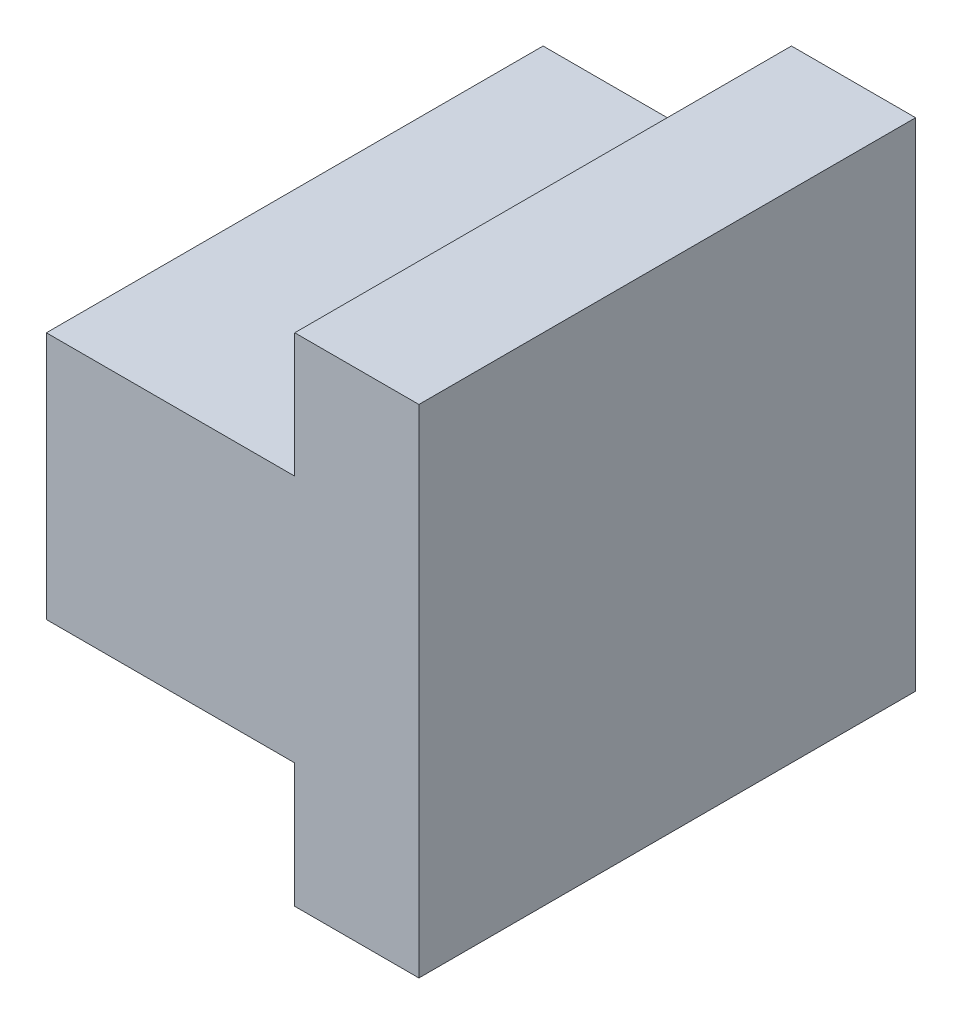
ISO-10303-21;
HEADER;
FILE_DESCRIPTION(('STEP AP214'),'2;1');
FILE_NAME('part.step','',(''),(''),'','','');
FILE_SCHEMA(('AUTOMOTIVE_DESIGN { 1 0 10303 214 1 1 1 1 }'));
ENDSEC;
DATA;
#1=APPLICATION_CONTEXT('core data for automotive mechanical design processes');
#2=APPLICATION_PROTOCOL_DEFINITION('international standard','automotive_design',2000,#1);
#3=PRODUCT_CONTEXT('',#1,'mechanical');
#4=PRODUCT('Part','Part','',(#3));
#5=PRODUCT_RELATED_PRODUCT_CATEGORY('part','',(#4));
#6=PRODUCT_DEFINITION_FORMATION('','',#4);
#7=PRODUCT_DEFINITION_CONTEXT('part definition',#1,'design');
#8=PRODUCT_DEFINITION('design','',#6,#7);
#9=PRODUCT_DEFINITION_SHAPE('','',#8);
#10=(LENGTH_UNIT() NAMED_UNIT(*) SI_UNIT(.MILLI.,.METRE.));
#11=(NAMED_UNIT(*) PLANE_ANGLE_UNIT() SI_UNIT($,.RADIAN.));
#12=(NAMED_UNIT(*) SI_UNIT($,.STERADIAN.) SOLID_ANGLE_UNIT());
#13=UNCERTAINTY_MEASURE_WITH_UNIT(LENGTH_MEASURE(1.E-05),#10,'distance_accuracy_value','');
#14=(GEOMETRIC_REPRESENTATION_CONTEXT(3) GLOBAL_UNCERTAINTY_ASSIGNED_CONTEXT((#13)) GLOBAL_UNIT_ASSIGNED_CONTEXT((#10,
#11,#12)) REPRESENTATION_CONTEXT('',''));
#15=CARTESIAN_POINT('',(0.,0.,0.));
#16=DIRECTION('',(0.,0.,1.));
#17=DIRECTION('',(1.,0.,0.));
#18=AXIS2_PLACEMENT_3D('',#15,#16,#17);
#19=CARTESIAN_POINT('',(1.,0.,4.));
#20=DIRECTION('',(0.,1.,0.));
#21=DIRECTION('',(-1.,0.,0.));
#22=AXIS2_PLACEMENT_3D('',#19,#20,#21);
#23=PLANE('',#22);
#24=DIRECTION('',(0.,0.,-1.));
#25=VECTOR('',#24,1.);
#26=CARTESIAN_POINT('',(1.,0.,4.));
#27=LINE('',#26,#25);
#28=CARTESIAN_POINT('',(1.,0.,3.));
#29=VERTEX_POINT('',#28);
#30=CARTESIAN_POINT('',(1.,0.,0.));
#31=VERTEX_POINT('',#30);
#32=EDGE_CURVE('E11',#29,#31,#27,.T.);
#33=ORIENTED_EDGE('',*,*,#32,.F.);
#34=DIRECTION('',(1.,0.,0.));
#35=VECTOR('',#34,1.);
#36=CARTESIAN_POINT('',(1.,0.,3.));
#37=LINE('',#36,#35);
#38=CARTESIAN_POINT('',(0.,0.,3.));
#39=VERTEX_POINT('',#38);
#40=EDGE_CURVE('E228',#39,#29,#37,.T.);
#41=ORIENTED_EDGE('',*,*,#40,.F.);
#42=DIRECTION('',(0.,0.,-1.));
#43=VECTOR('',#42,1.);
#44=CARTESIAN_POINT('',(0.,0.,4.));
#45=LINE('',#44,#43);
#46=CARTESIAN_POINT('',(0.,0.,0.));
#47=VERTEX_POINT('',#46);
#48=EDGE_CURVE('E98',#39,#47,#45,.T.);
#49=ORIENTED_EDGE('',*,*,#48,.T.);
#50=DIRECTION('',(1.,0.,0.));
#51=VECTOR('',#50,1.);
#52=CARTESIAN_POINT('',(1.,0.,0.));
#53=LINE('',#52,#51);
#54=EDGE_CURVE('E148',#47,#31,#53,.T.);
#55=ORIENTED_EDGE('',*,*,#54,.T.);
#56=EDGE_LOOP('',(#33,#41,#49,#55));
#57=FACE_BOUND('',#56,.T.);
#58=ADVANCED_FACE('F33',(#57),#23,.F.);
#59=CARTESIAN_POINT('',(1.,1.,4.));
#60=DIRECTION('',(-1.,0.,0.));
#61=DIRECTION('',(0.,0.,1.));
#62=AXIS2_PLACEMENT_3D('',#59,#60,#61);
#63=PLANE('',#62);
#64=DIRECTION('',(0.,0.,-1.));
#65=VECTOR('',#64,1.);
#66=CARTESIAN_POINT('',(1.,1.,4.));
#67=LINE('',#66,#65);
#68=CARTESIAN_POINT('',(1.,1.,3.));
#69=VERTEX_POINT('',#68);
#70=CARTESIAN_POINT('',(1.,1.,0.));
#71=VERTEX_POINT('',#70);
#72=EDGE_CURVE('E192',#69,#71,#67,.T.);
#73=ORIENTED_EDGE('',*,*,#72,.F.);
#74=DIRECTION('',(0.,1.,0.));
#75=VECTOR('',#74,1.);
#76=CARTESIAN_POINT('',(1.,3.,3.));
#77=LINE('',#76,#75);
#78=EDGE_CURVE('E234',#29,#69,#77,.T.);
#79=ORIENTED_EDGE('',*,*,#78,.F.);
#80=ORIENTED_EDGE('',*,*,#32,.T.);
#81=DIRECTION('',(0.,1.,0.));
#82=VECTOR('',#81,1.);
#83=CARTESIAN_POINT('',(1.,1.,0.));
#84=LINE('',#83,#82);
#85=EDGE_CURVE('E150',#31,#71,#84,.T.);
#86=ORIENTED_EDGE('',*,*,#85,.T.);
#87=EDGE_LOOP('',(#73,#79,#80,#86));
#88=FACE_BOUND('',#87,.T.);
#89=ADVANCED_FACE('F204',(#88),#63,.F.);
#90=CARTESIAN_POINT('',(3.,1.,4.));
#91=DIRECTION('',(0.,1.,0.));
#92=DIRECTION('',(-1.,0.,0.));
#93=AXIS2_PLACEMENT_3D('',#90,#91,#92);
#94=PLANE('',#93);
#95=DIRECTION('',(1.,0.,0.));
#96=VECTOR('',#95,1.);
#97=CARTESIAN_POINT('',(3.,1.,0.));
#98=LINE('',#97,#96);
#99=CARTESIAN_POINT('',(3.,1.,0.));
#100=VERTEX_POINT('',#99);
#101=EDGE_CURVE('E154',#71,#100,#98,.T.);
#102=ORIENTED_EDGE('',*,*,#101,.T.);
#103=DIRECTION('',(0.,0.,-1.));
#104=VECTOR('',#103,1.);
#105=CARTESIAN_POINT('',(3.,1.,4.));
#106=LINE('',#105,#104);
#107=CARTESIAN_POINT('',(3.,1.,4.));
#108=VERTEX_POINT('',#107);
#109=EDGE_CURVE('E190',#108,#100,#106,.T.);
#110=ORIENTED_EDGE('',*,*,#109,.F.);
#111=DIRECTION('',(1.,0.,0.));
#112=VECTOR('',#111,1.);
#113=CARTESIAN_POINT('',(3.,1.,4.));
#114=LINE('',#113,#112);
#115=CARTESIAN_POINT('',(1.,1.,4.));
#116=VERTEX_POINT('',#115);
#117=EDGE_CURVE('E175',#116,#108,#114,.T.);
#118=ORIENTED_EDGE('',*,*,#117,.F.);
#119=EDGE_CURVE('E41',#116,#69,#67,.T.);
#120=ORIENTED_EDGE('',*,*,#119,.T.);
#121=ORIENTED_EDGE('',*,*,#72,.T.);
#122=EDGE_LOOP('',(#102,#110,#118,#120,#121));
#123=FACE_BOUND('',#122,.T.);
#124=ADVANCED_FACE('F198',(#123),#94,.F.);
#125=CARTESIAN_POINT('',(3.,0.,4.));
#126=DIRECTION('',(1.,0.,0.));
#127=DIRECTION('',(0.,0.,-1.));
#128=AXIS2_PLACEMENT_3D('',#125,#126,#127);
#129=PLANE('',#128);
#130=DIRECTION('',(0.,-1.,0.));
#131=VECTOR('',#130,1.);
#132=CARTESIAN_POINT('',(3.,0.,0.));
#133=LINE('',#132,#131);
#134=CARTESIAN_POINT('',(3.,0.,0.));
#135=VERTEX_POINT('',#134);
#136=EDGE_CURVE('E156',#100,#135,#133,.T.);
#137=ORIENTED_EDGE('',*,*,#136,.T.);
#138=DIRECTION('',(0.,0.,-1.));
#139=VECTOR('',#138,1.);
#140=CARTESIAN_POINT('',(3.,0.,4.));
#141=LINE('',#140,#139);
#142=CARTESIAN_POINT('',(3.,0.,4.));
#143=VERTEX_POINT('',#142);
#144=EDGE_CURVE('E187',#143,#135,#141,.T.);
#145=ORIENTED_EDGE('',*,*,#144,.F.);
#146=DIRECTION('',(0.,-1.,0.));
#147=VECTOR('',#146,1.);
#148=CARTESIAN_POINT('',(3.,0.,4.));
#149=LINE('',#148,#147);
#150=EDGE_CURVE('E221',#108,#143,#149,.T.);
#151=ORIENTED_EDGE('',*,*,#150,.F.);
#152=ORIENTED_EDGE('',*,*,#109,.T.);
#153=EDGE_LOOP('',(#137,#145,#151,#152));
#154=FACE_BOUND('',#153,.T.);
#155=ADVANCED_FACE('F214',(#154),#129,.F.);
#156=CARTESIAN_POINT('',(4.,0.,4.));
#157=DIRECTION('',(0.,1.,0.));
#158=DIRECTION('',(-1.,0.,0.));
#159=AXIS2_PLACEMENT_3D('',#156,#157,#158);
#160=PLANE('',#159);
#161=DIRECTION('',(1.,0.,0.));
#162=VECTOR('',#161,1.);
#163=CARTESIAN_POINT('',(4.,0.,0.));
#164=LINE('',#163,#162);
#165=CARTESIAN_POINT('',(4.,0.,0.));
#166=VERTEX_POINT('',#165);
#167=EDGE_CURVE('E158',#135,#166,#164,.T.);
#168=ORIENTED_EDGE('',*,*,#167,.T.);
#169=DIRECTION('',(0.,0.,-1.));
#170=VECTOR('',#169,1.);
#171=CARTESIAN_POINT('',(4.,0.,4.));
#172=LINE('',#171,#170);
#173=CARTESIAN_POINT('',(4.,0.,4.));
#174=VERTEX_POINT('',#173);
#175=EDGE_CURVE('E184',#174,#166,#172,.T.);
#176=ORIENTED_EDGE('',*,*,#175,.F.);
#177=DIRECTION('',(1.,0.,0.));
#178=VECTOR('',#177,1.);
#179=CARTESIAN_POINT('',(4.,0.,4.));
#180=LINE('',#179,#178);
#181=EDGE_CURVE('E220',#143,#174,#180,.T.);
#182=ORIENTED_EDGE('',*,*,#181,.F.);
#183=ORIENTED_EDGE('',*,*,#144,.T.);
#184=EDGE_LOOP('',(#168,#176,#182,#183));
#185=FACE_BOUND('',#184,.T.);
#186=ADVANCED_FACE('F218',(#185),#160,.F.);
#187=CARTESIAN_POINT('',(4.,4.,4.));
#188=DIRECTION('',(-1.,0.,0.));
#189=DIRECTION('',(0.,-1.,0.));
#190=AXIS2_PLACEMENT_3D('',#187,#188,#189);
#191=PLANE('',#190);
#192=DIRECTION('',(0.,1.,0.));
#193=VECTOR('',#192,1.);
#194=CARTESIAN_POINT('',(4.,4.,0.));
#195=LINE('',#194,#193);
#196=CARTESIAN_POINT('',(4.,4.,0.));
#197=VERTEX_POINT('',#196);
#198=EDGE_CURVE('E160',#166,#197,#195,.T.);
#199=ORIENTED_EDGE('',*,*,#198,.T.);
#200=DIRECTION('',(0.,0.,-1.));
#201=VECTOR('',#200,1.);
#202=CARTESIAN_POINT('',(4.,4.,4.));
#203=LINE('',#202,#201);
#204=CARTESIAN_POINT('',(4.,4.,4.));
#205=VERTEX_POINT('',#204);
#206=EDGE_CURVE('E138',#205,#197,#203,.T.);
#207=ORIENTED_EDGE('',*,*,#206,.F.);
#208=DIRECTION('',(0.,1.,0.));
#209=VECTOR('',#208,1.);
#210=CARTESIAN_POINT('',(4.,4.,4.));
#211=LINE('',#210,#209);
#212=EDGE_CURVE('E126',#174,#205,#211,.T.);
#213=ORIENTED_EDGE('',*,*,#212,.F.);
#214=ORIENTED_EDGE('',*,*,#175,.T.);
#215=EDGE_LOOP('',(#199,#207,#213,#214));
#216=FACE_BOUND('',#215,.T.);
#217=ADVANCED_FACE('F271',(#216),#191,.F.);
#218=CARTESIAN_POINT('',(3.,4.,4.));
#219=DIRECTION('',(0.,-1.,0.));
#220=DIRECTION('',(0.,0.,-1.));
#221=AXIS2_PLACEMENT_3D('',#218,#219,#220);
#222=PLANE('',#221);
#223=DIRECTION('',(-1.,0.,0.));
#224=VECTOR('',#223,1.);
#225=CARTESIAN_POINT('',(3.,4.,0.));
#226=LINE('',#225,#224);
#227=CARTESIAN_POINT('',(3.,4.,0.));
#228=VERTEX_POINT('',#227);
#229=EDGE_CURVE('E135',#197,#228,#226,.T.);
#230=ORIENTED_EDGE('',*,*,#229,.T.);
#231=DIRECTION('',(0.,0.,-1.));
#232=VECTOR('',#231,1.);
#233=CARTESIAN_POINT('',(3.,4.,4.));
#234=LINE('',#233,#232);
#235=CARTESIAN_POINT('',(3.,4.,4.));
#236=VERTEX_POINT('',#235);
#237=EDGE_CURVE('E132',#236,#228,#234,.T.);
#238=ORIENTED_EDGE('',*,*,#237,.F.);
#239=DIRECTION('',(-1.,0.,0.));
#240=VECTOR('',#239,1.);
#241=CARTESIAN_POINT('',(3.,4.,4.));
#242=LINE('',#241,#240);
#243=EDGE_CURVE('E119',#205,#236,#242,.T.);
#244=ORIENTED_EDGE('',*,*,#243,.F.);
#245=ORIENTED_EDGE('',*,*,#206,.T.);
#246=EDGE_LOOP('',(#230,#238,#244,#245));
#247=FACE_BOUND('',#246,.T.);
#248=ADVANCED_FACE('F133',(#247),#222,.F.);
#249=CARTESIAN_POINT('',(3.,3.,4.));
#250=DIRECTION('',(1.,0.,0.));
#251=DIRECTION('',(0.,0.,-1.));
#252=AXIS2_PLACEMENT_3D('',#249,#250,#251);
#253=PLANE('',#252);
#254=DIRECTION('',(0.,-1.,0.));
#255=VECTOR('',#254,1.);
#256=CARTESIAN_POINT('',(3.,3.,0.));
#257=LINE('',#256,#255);
#258=CARTESIAN_POINT('',(3.,3.,0.));
#259=VERTEX_POINT('',#258);
#260=EDGE_CURVE('E163',#228,#259,#257,.T.);
#261=ORIENTED_EDGE('',*,*,#260,.T.);
#262=DIRECTION('',(0.,0.,-1.));
#263=VECTOR('',#262,1.);
#264=CARTESIAN_POINT('',(3.,3.,4.));
#265=LINE('',#264,#263);
#266=CARTESIAN_POINT('',(3.,3.,4.));
#267=VERTEX_POINT('',#266);
#268=EDGE_CURVE('E139',#267,#259,#265,.T.);
#269=ORIENTED_EDGE('',*,*,#268,.F.);
#270=DIRECTION('',(0.,-1.,0.));
#271=VECTOR('',#270,1.);
#272=CARTESIAN_POINT('',(3.,3.,4.));
#273=LINE('',#272,#271);
#274=EDGE_CURVE('E123',#236,#267,#273,.T.);
#275=ORIENTED_EDGE('',*,*,#274,.F.);
#276=ORIENTED_EDGE('',*,*,#237,.T.);
#277=EDGE_LOOP('',(#261,#269,#275,#276));
#278=FACE_BOUND('',#277,.T.);
#279=ADVANCED_FACE('F141',(#278),#253,.F.);
#280=CARTESIAN_POINT('',(1.,3.,4.));
#281=DIRECTION('',(0.,-1.,0.));
#282=DIRECTION('',(0.,0.,-1.));
#283=AXIS2_PLACEMENT_3D('',#280,#281,#282);
#284=PLANE('',#283);
#285=DIRECTION('',(-1.,0.,0.));
#286=VECTOR('',#285,1.);
#287=CARTESIAN_POINT('',(1.,3.,0.));
#288=LINE('',#287,#286);
#289=CARTESIAN_POINT('',(1.,3.,0.));
#290=VERTEX_POINT('',#289);
#291=EDGE_CURVE('E165',#259,#290,#288,.T.);
#292=ORIENTED_EDGE('',*,*,#291,.T.);
#293=DIRECTION('',(0.,0.,-1.));
#294=VECTOR('',#293,1.);
#295=CARTESIAN_POINT('',(1.,3.,4.));
#296=LINE('',#295,#294);
#297=CARTESIAN_POINT('',(1.,3.,4.));
#298=VERTEX_POINT('',#297);
#299=EDGE_CURVE('E180',#298,#290,#296,.T.);
#300=ORIENTED_EDGE('',*,*,#299,.F.);
#301=DIRECTION('',(-1.,0.,0.));
#302=VECTOR('',#301,1.);
#303=CARTESIAN_POINT('',(1.,3.,4.));
#304=LINE('',#303,#302);
#305=EDGE_CURVE('E49',#267,#298,#304,.T.);
#306=ORIENTED_EDGE('',*,*,#305,.F.);
#307=ORIENTED_EDGE('',*,*,#268,.T.);
#308=EDGE_LOOP('',(#292,#300,#306,#307));
#309=FACE_BOUND('',#308,.T.);
#310=ADVANCED_FACE('F279',(#309),#284,.F.);
#311=CARTESIAN_POINT('',(1.,2.,4.));
#312=DIRECTION('',(1.,0.,0.));
#313=DIRECTION('',(0.,0.,-1.));
#314=AXIS2_PLACEMENT_3D('',#311,#312,#313);
#315=PLANE('',#314);
#316=DIRECTION('',(0.,0.,-1.));
#317=VECTOR('',#316,1.);
#318=CARTESIAN_POINT('',(1.,2.,4.));
#319=LINE('',#318,#317);
#320=CARTESIAN_POINT('',(1.,2.,3.));
#321=VERTEX_POINT('',#320);
#322=CARTESIAN_POINT('',(1.,2.,0.));
#323=VERTEX_POINT('',#322);
#324=EDGE_CURVE('E178',#321,#323,#319,.T.);
#325=ORIENTED_EDGE('',*,*,#324,.F.);
#326=EDGE_CURVE('E236',#69,#321,#77,.T.);
#327=ORIENTED_EDGE('',*,*,#326,.F.);
#328=ORIENTED_EDGE('',*,*,#119,.F.);
#329=DIRECTION('',(0.,-1.,0.));
#330=VECTOR('',#329,1.);
#331=CARTESIAN_POINT('',(1.,2.,4.));
#332=LINE('',#331,#330);
#333=EDGE_CURVE('E103',#298,#116,#332,.T.);
#334=ORIENTED_EDGE('',*,*,#333,.F.);
#335=ORIENTED_EDGE('',*,*,#299,.T.);
#336=DIRECTION('',(0.,-1.,0.));
#337=VECTOR('',#336,1.);
#338=CARTESIAN_POINT('',(1.,2.,0.));
#339=LINE('',#338,#337);
#340=EDGE_CURVE('E168',#290,#323,#339,.T.);
#341=ORIENTED_EDGE('',*,*,#340,.T.);
#342=EDGE_LOOP('',(#325,#327,#328,#334,#335,#341));
#343=FACE_BOUND('',#342,.T.);
#344=ADVANCED_FACE('F247',(#343),#315,.F.);
#345=CARTESIAN_POINT('',(0.,2.,4.));
#346=DIRECTION('',(0.,-1.,0.));
#347=DIRECTION('',(1.,0.,0.));
#348=AXIS2_PLACEMENT_3D('',#345,#346,#347);
#349=PLANE('',#348);
#350=DIRECTION('',(0.,0.,-1.));
#351=VECTOR('',#350,1.);
#352=CARTESIAN_POINT('',(0.,2.,4.));
#353=LINE('',#352,#351);
#354=CARTESIAN_POINT('',(0.,2.,3.));
#355=VERTEX_POINT('',#354);
#356=CARTESIAN_POINT('',(0.,2.,0.));
#357=VERTEX_POINT('',#356);
#358=EDGE_CURVE('E90',#355,#357,#353,.T.);
#359=ORIENTED_EDGE('',*,*,#358,.F.);
#360=DIRECTION('',(1.,0.,0.));
#361=VECTOR('',#360,1.);
#362=CARTESIAN_POINT('',(0.,2.,3.));
#363=LINE('',#362,#361);
#364=EDGE_CURVE('E151',#355,#321,#363,.T.);
#365=ORIENTED_EDGE('',*,*,#364,.T.);
#366=ORIENTED_EDGE('',*,*,#324,.T.);
#367=DIRECTION('',(-1.,0.,0.));
#368=VECTOR('',#367,1.);
#369=CARTESIAN_POINT('',(0.,2.,0.));
#370=LINE('',#369,#368);
#371=EDGE_CURVE('E171',#323,#357,#370,.T.);
#372=ORIENTED_EDGE('',*,*,#371,.T.);
#373=EDGE_LOOP('',(#359,#365,#366,#372));
#374=FACE_BOUND('',#373,.T.);
#375=ADVANCED_FACE('F246',(#374),#349,.F.);
#376=CARTESIAN_POINT('',(0.,0.,4.));
#377=DIRECTION('',(1.,0.,0.));
#378=DIRECTION('',(0.,0.,-1.));
#379=AXIS2_PLACEMENT_3D('',#376,#377,#378);
#380=PLANE('',#379);
#381=ORIENTED_EDGE('',*,*,#48,.F.);
#382=DIRECTION('',(0.,-1.,0.));
#383=VECTOR('',#382,1.);
#384=CARTESIAN_POINT('',(0.,3.,3.));
#385=LINE('',#384,#383);
#386=EDGE_CURVE('E231',#355,#39,#385,.T.);
#387=ORIENTED_EDGE('',*,*,#386,.F.);
#388=ORIENTED_EDGE('',*,*,#358,.T.);
#389=DIRECTION('',(0.,-1.,0.));
#390=VECTOR('',#389,1.);
#391=CARTESIAN_POINT('',(0.,0.,0.));
#392=LINE('',#391,#390);
#393=EDGE_CURVE('E173',#357,#47,#392,.T.);
#394=ORIENTED_EDGE('',*,*,#393,.T.);
#395=EDGE_LOOP('',(#381,#387,#388,#394));
#396=FACE_BOUND('',#395,.T.);
#397=ADVANCED_FACE('F252',(#396),#380,.F.);
#398=CARTESIAN_POINT('',(0.,0.,4.));
#399=DIRECTION('',(0.,0.,-1.));
#400=DIRECTION('',(-1.,0.,0.));
#401=AXIS2_PLACEMENT_3D('',#398,#399,#400);
#402=PLANE('',#401);
#403=ORIENTED_EDGE('',*,*,#333,.T.);
#404=ORIENTED_EDGE('',*,*,#117,.T.);
#405=ORIENTED_EDGE('',*,*,#150,.T.);
#406=ORIENTED_EDGE('',*,*,#181,.T.);
#407=ORIENTED_EDGE('',*,*,#212,.T.);
#408=ORIENTED_EDGE('',*,*,#243,.T.);
#409=ORIENTED_EDGE('',*,*,#274,.T.);
#410=ORIENTED_EDGE('',*,*,#305,.T.);
#411=EDGE_LOOP('',(#403,#404,#405,#406,#407,#408,#409,#410));
#412=FACE_BOUND('',#411,.T.);
#413=ADVANCED_FACE('F121',(#412),#402,.F.);
#414=CARTESIAN_POINT('',(0.,0.,0.));
#415=DIRECTION('',(0.,0.,-1.));
#416=DIRECTION('',(-1.,0.,0.));
#417=AXIS2_PLACEMENT_3D('',#414,#415,#416);
#418=PLANE('',#417);
#419=ORIENTED_EDGE('',*,*,#54,.F.);
#420=ORIENTED_EDGE('',*,*,#393,.F.);
#421=ORIENTED_EDGE('',*,*,#371,.F.);
#422=ORIENTED_EDGE('',*,*,#340,.F.);
#423=ORIENTED_EDGE('',*,*,#291,.F.);
#424=ORIENTED_EDGE('',*,*,#260,.F.);
#425=ORIENTED_EDGE('',*,*,#229,.F.);
#426=ORIENTED_EDGE('',*,*,#198,.F.);
#427=ORIENTED_EDGE('',*,*,#167,.F.);
#428=ORIENTED_EDGE('',*,*,#136,.F.);
#429=ORIENTED_EDGE('',*,*,#101,.F.);
#430=ORIENTED_EDGE('',*,*,#85,.F.);
#431=EDGE_LOOP('',(#419,#420,#421,#422,#423,#424,#425,#426,#427,#428,#429,#430));
#432=FACE_BOUND('',#431,.T.);
#433=ADVANCED_FACE('F209',(#432),#418,.T.);
#434=CARTESIAN_POINT('',(0.,0.,3.));
#435=DIRECTION('',(0.,0.,-1.));
#436=DIRECTION('',(-1.,0.,0.));
#437=AXIS2_PLACEMENT_3D('',#434,#435,#436);
#438=PLANE('',#437);
#439=ORIENTED_EDGE('',*,*,#386,.T.);
#440=ORIENTED_EDGE('',*,*,#40,.T.);
#441=ORIENTED_EDGE('',*,*,#78,.T.);
#442=ORIENTED_EDGE('',*,*,#326,.T.);
#443=ORIENTED_EDGE('',*,*,#364,.F.);
#444=EDGE_LOOP('',(#439,#440,#441,#442,#443));
#445=FACE_BOUND('',#444,.T.);
#446=ADVANCED_FACE('F241',(#445),#438,.F.);
#447=CLOSED_SHELL('',(#58,#89,#124,#155,#186,#217,#248,#279,#310,#344,#375,#397,#413,#433,#446));
#448=MANIFOLD_SOLID_BREP('B2',#447);
#449=ADVANCED_BREP_SHAPE_REPRESENTATION('',(#18,#448),#14);
#450=SHAPE_DEFINITION_REPRESENTATION(#9,#449);
ENDSEC;
END-ISO-10303-21;
